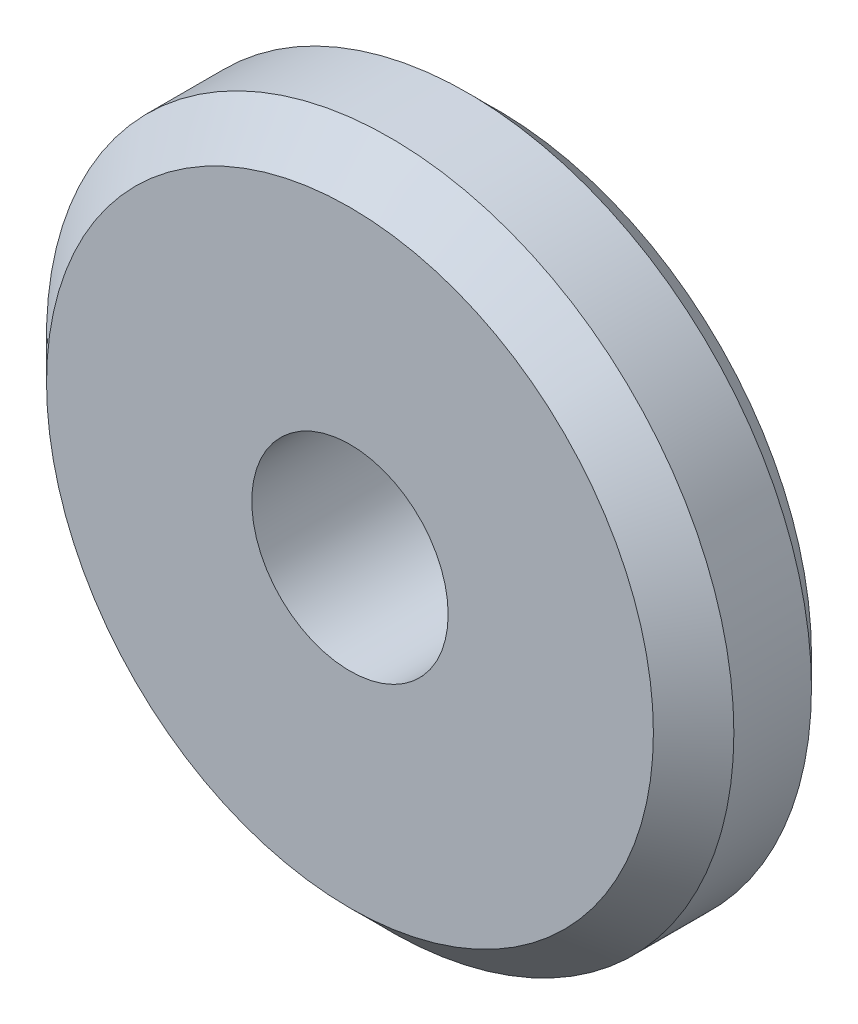
ISO-10303-21;
HEADER;
FILE_DESCRIPTION(('STEP AP214'),'2;1');
FILE_NAME('part.step','',(''),(''),'','','');
FILE_SCHEMA(('AUTOMOTIVE_DESIGN { 1 0 10303 214 1 1 1 1 }'));
ENDSEC;
DATA;
#1=APPLICATION_CONTEXT('core data for automotive mechanical design processes');
#2=APPLICATION_PROTOCOL_DEFINITION('international standard','automotive_design',2000,#1);
#3=PRODUCT_CONTEXT('',#1,'mechanical');
#4=PRODUCT('Part','Part','',(#3));
#5=PRODUCT_RELATED_PRODUCT_CATEGORY('part','',(#4));
#6=PRODUCT_DEFINITION_FORMATION('','',#4);
#7=PRODUCT_DEFINITION_CONTEXT('part definition',#1,'design');
#8=PRODUCT_DEFINITION('design','',#6,#7);
#9=PRODUCT_DEFINITION_SHAPE('','',#8);
#10=(LENGTH_UNIT() NAMED_UNIT(*) SI_UNIT(.MILLI.,.METRE.));
#11=(NAMED_UNIT(*) PLANE_ANGLE_UNIT() SI_UNIT($,.RADIAN.));
#12=(NAMED_UNIT(*) SI_UNIT($,.STERADIAN.) SOLID_ANGLE_UNIT());
#13=UNCERTAINTY_MEASURE_WITH_UNIT(LENGTH_MEASURE(1.E-05),#10,'distance_accuracy_value','');
#14=(GEOMETRIC_REPRESENTATION_CONTEXT(3) GLOBAL_UNCERTAINTY_ASSIGNED_CONTEXT((#13)) GLOBAL_UNIT_ASSIGNED_CONTEXT((#10,
#11,#12)) REPRESENTATION_CONTEXT('',''));
#15=CARTESIAN_POINT('',(0.,0.,0.));
#16=DIRECTION('',(0.,0.,1.));
#17=DIRECTION('',(1.,0.,0.));
#18=AXIS2_PLACEMENT_3D('',#15,#16,#17);
#19=CARTESIAN_POINT('',(41.11763763428,-17.11752891541,14.6492650189805));
#20=DIRECTION('',(0.,0.,1.));
#21=DIRECTION('',(1.,0.,0.));
#22=AXIS2_PLACEMENT_3D('',#19,#20,#21);
#23=CONICAL_SURFACE('',#22,0.854000000005676,0.785398163302709);
#24=CARTESIAN_POINT('',(41.11763763428,-17.11752891541,14.6492650189964));
#25=DIRECTION('',(0.,0.,1.));
#26=DIRECTION('',(1.,0.,0.));
#27=AXIS2_PLACEMENT_3D('',#24,#25,#26);
#28=CIRCLE('',#27,0.854);
#29=CARTESIAN_POINT('',(41.97163763428,-17.11752891541,14.6492650189964));
#30=VERTEX_POINT('',#29);
#31=EDGE_CURVE('E56',#30,#30,#28,.T.);
#32=ORIENTED_EDGE('',*,*,#31,.F.);
#33=EDGE_LOOP('',(#32));
#34=FACE_BOUND('',#33,.T.);
#35=CARTESIAN_POINT('',(41.11763763428,-17.11752891541,14.576065018985));
#36=DIRECTION('',(0.,0.,1.));
#37=DIRECTION('',(1.,0.,0.));
#38=AXIS2_PLACEMENT_3D('',#35,#36,#37);
#39=CIRCLE('',#38,0.780800000024051);
#40=CARTESIAN_POINT('',(41.8984376343041,-17.11752891541,14.576065018985));
#41=VERTEX_POINT('',#40);
#42=EDGE_CURVE('E53',#41,#41,#39,.T.);
#43=ORIENTED_EDGE('',*,*,#42,.T.);
#44=EDGE_LOOP('',(#43));
#45=FACE_BOUND('',#44,.T.);
#46=ADVANCED_FACE('F35',(#34,#45),#23,.T.);
#47=CARTESIAN_POINT('',(41.11763763428,-17.11752891541,14.5760650189964));
#48=DIRECTION('',(0.,0.,1.));
#49=DIRECTION('',(1.,0.,0.));
#50=AXIS2_PLACEMENT_3D('',#47,#48,#49);
#51=PLANE('',#50);
#52=CARTESIAN_POINT('',(41.11763763428,-17.11752891541,14.5760650189964));
#53=DIRECTION('',(0.,0.,1.));
#54=DIRECTION('',(1.,0.,0.));
#55=AXIS2_PLACEMENT_3D('',#52,#53,#54);
#56=CIRCLE('',#55,0.244);
#57=CARTESIAN_POINT('',(41.36163763428,-17.11752891541,14.5760650189964));
#58=VERTEX_POINT('',#57);
#59=EDGE_CURVE('E50',#58,#58,#56,.T.);
#60=ORIENTED_EDGE('',*,*,#59,.T.);
#61=EDGE_LOOP('',(#60));
#62=FACE_BOUND('',#61,.T.);
#63=ORIENTED_EDGE('',*,*,#42,.F.);
#64=EDGE_LOOP('',(#63));
#65=FACE_BOUND('',#64,.T.);
#66=ADVANCED_FACE('F68',(#62,#65),#51,.F.);
#67=CARTESIAN_POINT('',(41.11763763428,-17.11752891541,14.5760650189964));
#68=DIRECTION('',(0.,0.,1.));
#69=DIRECTION('',(1.,0.,0.));
#70=AXIS2_PLACEMENT_3D('',#67,#68,#69);
#71=CYLINDRICAL_SURFACE('',#70,0.854);
#72=CARTESIAN_POINT('',(41.11763763428,-17.11752891541,14.8420650189964));
#73=DIRECTION('',(0.,0.,1.));
#74=DIRECTION('',(1.,0.,0.));
#75=AXIS2_PLACEMENT_3D('',#72,#73,#74);
#76=CIRCLE('',#75,0.854);
#77=CARTESIAN_POINT('',(41.97163763428,-17.11752891541,14.8420650189964));
#78=VERTEX_POINT('',#77);
#79=EDGE_CURVE('E10',#78,#78,#76,.F.);
#80=ORIENTED_EDGE('',*,*,#79,.T.);
#81=EDGE_LOOP('',(#80));
#82=FACE_BOUND('',#81,.T.);
#83=ORIENTED_EDGE('',*,*,#31,.T.);
#84=EDGE_LOOP('',(#83));
#85=FACE_BOUND('',#84,.T.);
#86=ADVANCED_FACE('F64',(#82,#85),#71,.T.);
#87=CARTESIAN_POINT('',(41.11763763428,-17.11752891541,14.5760650189964));
#88=DIRECTION('',(0.,0.,1.));
#89=DIRECTION('',(1.,0.,0.));
#90=AXIS2_PLACEMENT_3D('',#87,#88,#89);
#91=CYLINDRICAL_SURFACE('',#90,0.244);
#92=ORIENTED_EDGE('',*,*,#59,.F.);
#93=EDGE_LOOP('',(#92));
#94=FACE_BOUND('',#93,.T.);
#95=CARTESIAN_POINT('',(41.11763763428,-17.11752891541,14.9420650189964));
#96=DIRECTION('',(0.,0.,1.));
#97=DIRECTION('',(1.,0.,0.));
#98=AXIS2_PLACEMENT_3D('',#95,#96,#97);
#99=CIRCLE('',#98,0.244);
#100=CARTESIAN_POINT('',(41.36163763428,-17.11752891541,14.9420650189964));
#101=VERTEX_POINT('',#100);
#102=EDGE_CURVE('E46',#101,#101,#99,.F.);
#103=ORIENTED_EDGE('',*,*,#102,.F.);
#104=EDGE_LOOP('',(#103));
#105=FACE_BOUND('',#104,.T.);
#106=ADVANCED_FACE('F77',(#94,#105),#91,.F.);
#107=CARTESIAN_POINT('',(41.11763763428,-17.11752891541,14.9420650189964));
#108=DIRECTION('',(0.,0.,1.));
#109=DIRECTION('',(1.,0.,0.));
#110=AXIS2_PLACEMENT_3D('',#107,#108,#109);
#111=PLANE('',#110);
#112=CARTESIAN_POINT('',(41.11763763428,-17.11752891541,14.9420650189964));
#113=DIRECTION('',(0.,0.,1.));
#114=DIRECTION('',(1.,0.,0.));
#115=AXIS2_PLACEMENT_3D('',#112,#113,#114);
#116=CIRCLE('',#115,0.754000000000005);
#117=CARTESIAN_POINT('',(41.87163763428,-17.11752891541,14.9420650189964));
#118=VERTEX_POINT('',#117);
#119=EDGE_CURVE('E42',#118,#118,#116,.T.);
#120=ORIENTED_EDGE('',*,*,#119,.T.);
#121=EDGE_LOOP('',(#120));
#122=FACE_BOUND('',#121,.T.);
#123=ORIENTED_EDGE('',*,*,#102,.T.);
#124=EDGE_LOOP('',(#123));
#125=FACE_BOUND('',#124,.T.);
#126=ADVANCED_FACE('F79',(#122,#125),#111,.T.);
#127=CARTESIAN_POINT('',(41.11763763428,-17.11752891541,14.9420650189964));
#128=DIRECTION('',(0.,0.,-1.));
#129=DIRECTION('',(-1.,0.,0.));
#130=AXIS2_PLACEMENT_3D('',#127,#128,#129);
#131=CONICAL_SURFACE('',#130,0.754000000000005,0.785398163397446);
#132=ORIENTED_EDGE('',*,*,#79,.F.);
#133=EDGE_LOOP('',(#132));
#134=FACE_BOUND('',#133,.T.);
#135=ORIENTED_EDGE('',*,*,#119,.F.);
#136=EDGE_LOOP('',(#135));
#137=FACE_BOUND('',#136,.T.);
#138=ADVANCED_FACE('F37',(#134,#137),#131,.T.);
#139=CLOSED_SHELL('',(#46,#66,#86,#106,#126,#138));
#140=MANIFOLD_SOLID_BREP('B2',#139);
#141=ADVANCED_BREP_SHAPE_REPRESENTATION('',(#18,#140),#14);
#142=SHAPE_DEFINITION_REPRESENTATION(#9,#141);
ENDSEC;
END-ISO-10303-21;
